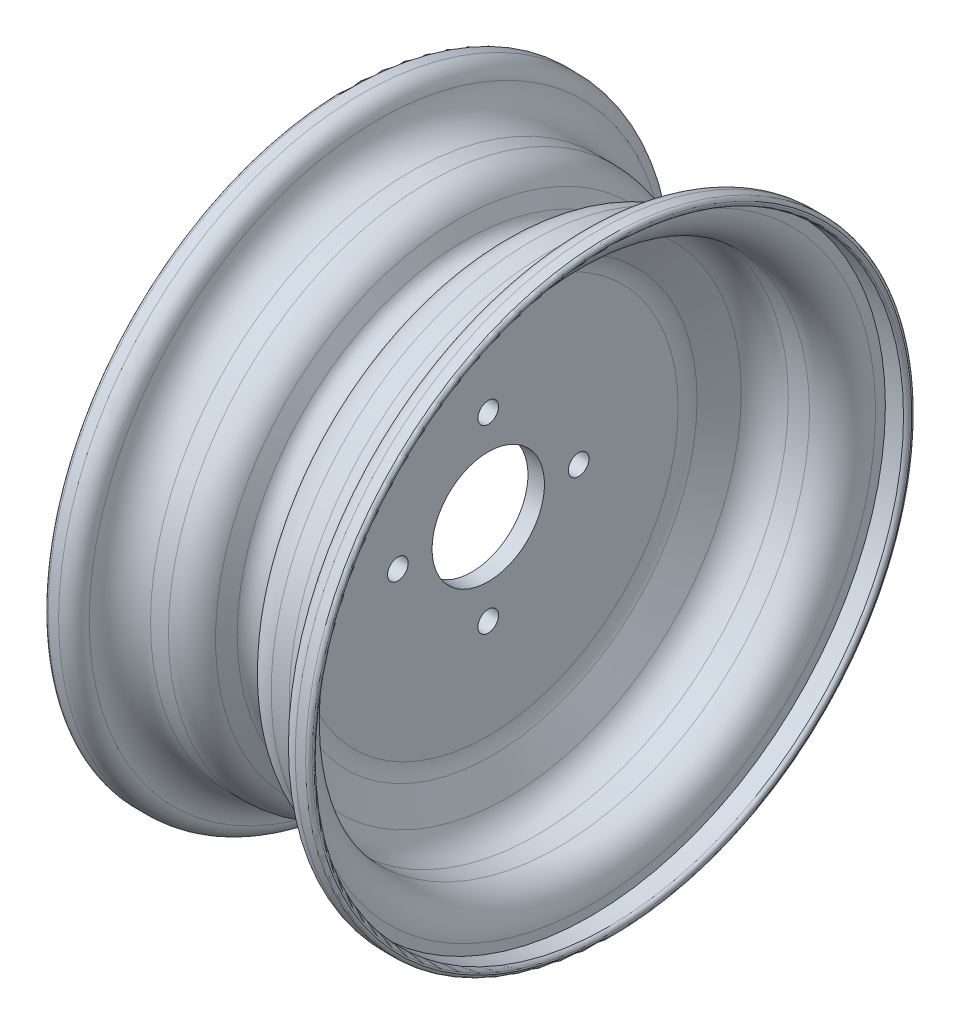
ISO-10303-21;
HEADER;
FILE_DESCRIPTION(('STEP AP214'),'2;1');
FILE_NAME('part.step','',(''),(''),'','','');
FILE_SCHEMA(('AUTOMOTIVE_DESIGN { 1 0 10303 214 1 1 1 1 }'));
ENDSEC;
DATA;
#1=APPLICATION_CONTEXT('core data for automotive mechanical design processes');
#2=APPLICATION_PROTOCOL_DEFINITION('international standard','automotive_design',2000,#1);
#3=PRODUCT_CONTEXT('',#1,'mechanical');
#4=PRODUCT('Part','Part','',(#3));
#5=PRODUCT_RELATED_PRODUCT_CATEGORY('part','',(#4));
#6=PRODUCT_DEFINITION_FORMATION('','',#4);
#7=PRODUCT_DEFINITION_CONTEXT('part definition',#1,'design');
#8=PRODUCT_DEFINITION('design','',#6,#7);
#9=PRODUCT_DEFINITION_SHAPE('','',#8);
#10=(LENGTH_UNIT() NAMED_UNIT(*) SI_UNIT(.MILLI.,.METRE.));
#11=(NAMED_UNIT(*) PLANE_ANGLE_UNIT() SI_UNIT($,.RADIAN.));
#12=(NAMED_UNIT(*) SI_UNIT($,.STERADIAN.) SOLID_ANGLE_UNIT());
#13=UNCERTAINTY_MEASURE_WITH_UNIT(LENGTH_MEASURE(1.E-05),#10,'distance_accuracy_value','');
#14=(GEOMETRIC_REPRESENTATION_CONTEXT(3) GLOBAL_UNCERTAINTY_ASSIGNED_CONTEXT((#13)) GLOBAL_UNIT_ASSIGNED_CONTEXT((#10,
#11,#12)) REPRESENTATION_CONTEXT('',''));
#15=CARTESIAN_POINT('',(0.,0.,0.));
#16=DIRECTION('',(0.,0.,1.));
#17=DIRECTION('',(1.,0.,0.));
#18=AXIS2_PLACEMENT_3D('',#15,#16,#17);
#19=CARTESIAN_POINT('',(0.,0.,0.));
#20=DIRECTION('',(-1.,0.,0.));
#21=DIRECTION('',(0.,0.,1.));
#22=AXIS2_PLACEMENT_3D('',#19,#20,#21);
#23=CYLINDRICAL_SURFACE('',#22,21.6360375);
#24=CARTESIAN_POINT('',(3.17500000000001,0.,0.));
#25=DIRECTION('',(-1.,0.,0.));
#26=DIRECTION('',(0.,0.,1.));
#27=AXIS2_PLACEMENT_3D('',#24,#25,#26);
#28=CIRCLE('',#27,21.6360375);
#29=CARTESIAN_POINT('',(3.17500000000001,0.,21.6360375));
#30=VERTEX_POINT('',#29);
#31=EDGE_CURVE('E139',#30,#30,#28,.T.);
#32=ORIENTED_EDGE('',*,*,#31,.F.);
#33=EDGE_LOOP('',(#32));
#34=FACE_BOUND('',#33,.T.);
#35=CARTESIAN_POINT('',(-3.17500000000001,0.,0.));
#36=DIRECTION('',(-1.,0.,0.));
#37=DIRECTION('',(0.,0.,1.));
#38=AXIS2_PLACEMENT_3D('',#35,#36,#37);
#39=CIRCLE('',#38,21.6360375);
#40=CARTESIAN_POINT('',(-3.17500000000001,0.,21.6360375));
#41=VERTEX_POINT('',#40);
#42=EDGE_CURVE('E157',#41,#41,#39,.T.);
#43=ORIENTED_EDGE('',*,*,#42,.T.);
#44=EDGE_LOOP('',(#43));
#45=FACE_BOUND('',#44,.T.);
#46=ADVANCED_FACE('F35',(#34,#45),#23,.F.);
#47=CARTESIAN_POINT('',(3.175,21.6360375,0.));
#48=DIRECTION('',(-1.,0.,0.));
#49=DIRECTION('',(0.,0.,1.));
#50=AXIS2_PLACEMENT_3D('',#47,#48,#49);
#51=PLANE('',#50);
#52=CARTESIAN_POINT('',(3.175,3.6448970288719E-13,34.798));
#53=DIRECTION('',(1.,0.,0.));
#54=DIRECTION('',(0.,1.,0.));
#55=AXIS2_PLACEMENT_3D('',#52,#53,#54);
#56=CIRCLE('',#55,3.9751);
#57=CARTESIAN_POINT('',(3.175,3.97510000000036,34.798));
#58=VERTEX_POINT('',#57);
#59=EDGE_CURVE('E154',#58,#58,#56,.T.);
#60=ORIENTED_EDGE('',*,*,#59,.F.);
#61=EDGE_LOOP('',(#60));
#62=FACE_BOUND('',#61,.T.);
#63=CARTESIAN_POINT('',(3.175,-34.798,0.));
#64=DIRECTION('',(1.,0.,0.));
#65=DIRECTION('',(0.,0.,1.));
#66=AXIS2_PLACEMENT_3D('',#63,#64,#65);
#67=CIRCLE('',#66,3.9751);
#68=CARTESIAN_POINT('',(3.175,-34.798,3.9751));
#69=VERTEX_POINT('',#68);
#70=EDGE_CURVE('E151',#69,#69,#67,.T.);
#71=ORIENTED_EDGE('',*,*,#70,.F.);
#72=EDGE_LOOP('',(#71));
#73=FACE_BOUND('',#72,.T.);
#74=CARTESIAN_POINT('',(3.175,-1.21496567629063E-13,-34.798));
#75=DIRECTION('',(1.,0.,0.));
#76=DIRECTION('',(0.,-1.,0.));
#77=AXIS2_PLACEMENT_3D('',#74,#75,#76);
#78=CIRCLE('',#77,3.9751);
#79=CARTESIAN_POINT('',(3.175,-3.97510000000012,-34.798));
#80=VERTEX_POINT('',#79);
#81=EDGE_CURVE('E148',#80,#80,#78,.T.);
#82=ORIENTED_EDGE('',*,*,#81,.F.);
#83=EDGE_LOOP('',(#82));
#84=FACE_BOUND('',#83,.T.);
#85=CARTESIAN_POINT('',(3.175,34.798,0.));
#86=DIRECTION('',(1.,0.,0.));
#87=DIRECTION('',(0.,0.,-1.));
#88=AXIS2_PLACEMENT_3D('',#85,#86,#87);
#89=CIRCLE('',#88,3.9751);
#90=CARTESIAN_POINT('',(3.175,34.798,-3.9751));
#91=VERTEX_POINT('',#90);
#92=EDGE_CURVE('E145',#91,#91,#89,.T.);
#93=ORIENTED_EDGE('',*,*,#92,.F.);
#94=EDGE_LOOP('',(#93));
#95=FACE_BOUND('',#94,.T.);
#96=CARTESIAN_POINT('',(3.175,0.,0.));
#97=DIRECTION('',(-1.,0.,0.));
#98=DIRECTION('',(0.,0.,1.));
#99=AXIS2_PLACEMENT_3D('',#96,#97,#98);
#100=CIRCLE('',#99,73.1001867170901);
#101=CARTESIAN_POINT('',(3.175,0.,73.1001867170901));
#102=VERTEX_POINT('',#101);
#103=EDGE_CURVE('E94',#102,#102,#100,.F.);
#104=ORIENTED_EDGE('',*,*,#103,.T.);
#105=EDGE_LOOP('',(#104));
#106=FACE_BOUND('',#105,.T.);
#107=ORIENTED_EDGE('',*,*,#31,.T.);
#108=EDGE_LOOP('',(#107));
#109=FACE_BOUND('',#108,.T.);
#110=ADVANCED_FACE('F194',(#62,#73,#84,#95,#106,#109),#51,.F.);
#111=CARTESIAN_POINT('',(3.175,0.,0.));
#112=DIRECTION('',(1.,0.,0.));
#113=DIRECTION('',(0.,0.,-1.));
#114=AXIS2_PLACEMENT_3D('',#111,#112,#113);
#115=CONICAL_SURFACE('',#114,76.2,1.09199836191932);
#116=CARTESIAN_POINT('',(10.4148201420796,0.,0.));
#117=DIRECTION('',(1.,0.,0.));
#118=DIRECTION('',(0.,0.,-1.));
#119=AXIS2_PLACEMENT_3D('',#116,#117,#118);
#120=CIRCLE('',#119,90.14730056783);
#121=CARTESIAN_POINT('',(10.4148201420796,0.,-90.14730056783));
#122=VERTEX_POINT('',#121);
#123=EDGE_CURVE('E97',#122,#122,#120,.T.);
#124=ORIENTED_EDGE('',*,*,#123,.T.);
#125=EDGE_LOOP('',(#124));
#126=FACE_BOUND('',#125,.T.);
#127=CARTESIAN_POINT('',(4.60312317079817,0.,0.));
#128=DIRECTION('',(1.,0.,0.));
#129=DIRECTION('',(0.,0.,-1.));
#130=AXIS2_PLACEMENT_3D('',#127,#128,#129);
#131=CIRCLE('',#130,78.95123728492);
#132=CARTESIAN_POINT('',(4.60312317079817,0.,-78.95123728492));
#133=VERTEX_POINT('',#132);
#134=EDGE_CURVE('E100',#133,#133,#131,.F.);
#135=ORIENTED_EDGE('',*,*,#134,.T.);
#136=EDGE_LOOP('',(#135));
#137=FACE_BOUND('',#136,.T.);
#138=ADVANCED_FACE('F201',(#126,#137),#115,.F.);
#139=CARTESIAN_POINT('',(0.,0.,0.));
#140=DIRECTION('',(-1.,0.,0.));
#141=DIRECTION('',(0.,0.,1.));
#142=AXIS2_PLACEMENT_3D('',#139,#140,#141);
#143=CYLINDRICAL_SURFACE('',#142,96.99625);
#144=CARTESIAN_POINT('',(21.6866969712815,0.,0.));
#145=DIRECTION('',(-1.,0.,0.));
#146=DIRECTION('',(0.,0.,1.));
#147=AXIS2_PLACEMENT_3D('',#144,#145,#146);
#148=CIRCLE('',#147,96.99625);
#149=CARTESIAN_POINT('',(21.6866969712815,0.,96.99625));
#150=VERTEX_POINT('',#149);
#151=EDGE_CURVE('E103',#150,#150,#148,.T.);
#152=ORIENTED_EDGE('',*,*,#151,.T.);
#153=EDGE_LOOP('',(#152));
#154=FACE_BOUND('',#153,.T.);
#155=CARTESIAN_POINT('',(29.845,0.,0.));
#156=DIRECTION('',(-1.,0.,0.));
#157=DIRECTION('',(0.,0.,1.));
#158=AXIS2_PLACEMENT_3D('',#155,#156,#157);
#159=CIRCLE('',#158,96.99625);
#160=CARTESIAN_POINT('',(29.845,0.,96.99625));
#161=VERTEX_POINT('',#160);
#162=EDGE_CURVE('E106',#161,#161,#159,.F.);
#163=ORIENTED_EDGE('',*,*,#162,.T.);
#164=EDGE_LOOP('',(#163));
#165=FACE_BOUND('',#164,.T.);
#166=ADVANCED_FACE('F437',(#154,#165),#143,.F.);
#167=CARTESIAN_POINT('',(42.545,96.99625,0.));
#168=DIRECTION('',(-1.,0.,0.));
#169=DIRECTION('',(0.,0.,1.));
#170=AXIS2_PLACEMENT_3D('',#167,#168,#169);
#171=PLANE('',#170);
#172=CARTESIAN_POINT('',(42.545,0.,0.));
#173=DIRECTION('',(-1.,0.,0.));
#174=DIRECTION('',(0.,0.,1.));
#175=AXIS2_PLACEMENT_3D('',#172,#173,#174);
#176=CIRCLE('',#175,109.69625);
#177=CARTESIAN_POINT('',(42.545,0.,109.69625));
#178=VERTEX_POINT('',#177);
#179=EDGE_CURVE('E109',#178,#178,#176,.T.);
#180=ORIENTED_EDGE('',*,*,#179,.T.);
#181=EDGE_LOOP('',(#180));
#182=FACE_BOUND('',#181,.T.);
#183=CARTESIAN_POINT('',(42.545,0.,0.));
#184=DIRECTION('',(-1.,0.,0.));
#185=DIRECTION('',(0.,0.,1.));
#186=AXIS2_PLACEMENT_3D('',#183,#184,#185);
#187=CIRCLE('',#186,113.50625);
#188=CARTESIAN_POINT('',(42.545,0.,113.50625));
#189=VERTEX_POINT('',#188);
#190=EDGE_CURVE('E142',#189,#189,#187,.T.);
#191=ORIENTED_EDGE('',*,*,#190,.F.);
#192=EDGE_LOOP('',(#191));
#193=FACE_BOUND('',#192,.T.);
#194=ADVANCED_FACE('F444',(#182,#193),#171,.F.);
#195=CARTESIAN_POINT('',(0.,0.,0.));
#196=DIRECTION('',(-1.,0.,0.));
#197=DIRECTION('',(0.,0.,1.));
#198=AXIS2_PLACEMENT_3D('',#195,#196,#197);
#199=CYLINDRICAL_SURFACE('',#198,113.50625);
#200=CARTESIAN_POINT('',(49.53,0.,0.));
#201=DIRECTION('',(-1.,0.,0.));
#202=DIRECTION('',(0.,0.,1.));
#203=AXIS2_PLACEMENT_3D('',#200,#201,#202);
#204=CIRCLE('',#203,113.50625);
#205=CARTESIAN_POINT('',(49.53,0.,113.50625));
#206=VERTEX_POINT('',#205);
#207=EDGE_CURVE('E115',#206,#206,#204,.F.);
#208=ORIENTED_EDGE('',*,*,#207,.T.);
#209=EDGE_LOOP('',(#208));
#210=FACE_BOUND('',#209,.T.);
#211=ORIENTED_EDGE('',*,*,#190,.T.);
#212=EDGE_LOOP('',(#211));
#213=FACE_BOUND('',#212,.T.);
#214=ADVANCED_FACE('F452',(#210,#213),#199,.F.);
#215=CARTESIAN_POINT('',(50.8,113.50625,0.));
#216=DIRECTION('',(-1.,0.,0.));
#217=DIRECTION('',(0.,0.,1.));
#218=AXIS2_PLACEMENT_3D('',#215,#216,#217);
#219=PLANE('',#218);
#220=CARTESIAN_POINT('',(50.8,0.,0.));
#221=DIRECTION('',(-1.,0.,0.));
#222=DIRECTION('',(0.,0.,1.));
#223=AXIS2_PLACEMENT_3D('',#220,#221,#222);
#224=CIRCLE('',#223,114.77625);
#225=CARTESIAN_POINT('',(50.8,0.,114.77625));
#226=VERTEX_POINT('',#225);
#227=EDGE_CURVE('E118',#226,#226,#224,.T.);
#228=ORIENTED_EDGE('',*,*,#227,.T.);
#229=EDGE_LOOP('',(#228));
#230=FACE_BOUND('',#229,.T.);
#231=CARTESIAN_POINT('',(50.8,0.,0.));
#232=DIRECTION('',(-1.,0.,0.));
#233=DIRECTION('',(0.,0.,1.));
#234=AXIS2_PLACEMENT_3D('',#231,#232,#233);
#235=CIRCLE('',#234,115.41125);
#236=CARTESIAN_POINT('',(50.8,0.,115.41125));
#237=VERTEX_POINT('',#236);
#238=EDGE_CURVE('E121',#237,#237,#235,.F.);
#239=ORIENTED_EDGE('',*,*,#238,.T.);
#240=EDGE_LOOP('',(#239));
#241=FACE_BOUND('',#240,.T.);
#242=ADVANCED_FACE('F460',(#230,#241),#219,.F.);
#243=CARTESIAN_POINT('',(0.,0.,0.));
#244=DIRECTION('',(-1.,0.,0.));
#245=DIRECTION('',(0.,0.,1.));
#246=AXIS2_PLACEMENT_3D('',#243,#244,#245);
#247=CYLINDRICAL_SURFACE('',#246,116.68125);
#248=CARTESIAN_POINT('',(49.53,0.,0.));
#249=DIRECTION('',(-1.,0.,0.));
#250=DIRECTION('',(0.,0.,1.));
#251=AXIS2_PLACEMENT_3D('',#248,#249,#250);
#252=CIRCLE('',#251,116.68125);
#253=CARTESIAN_POINT('',(49.53,0.,116.68125));
#254=VERTEX_POINT('',#253);
#255=EDGE_CURVE('E112',#254,#254,#252,.T.);
#256=ORIENTED_EDGE('',*,*,#255,.T.);
#257=EDGE_LOOP('',(#256));
#258=FACE_BOUND('',#257,.T.);
#259=CARTESIAN_POINT('',(45.5499073090945,0.,0.));
#260=DIRECTION('',(1.,0.,0.));
#261=DIRECTION('',(0.,0.,-1.));
#262=AXIS2_PLACEMENT_3D('',#259,#260,#261);
#263=CIRCLE('',#262,116.68125);
#264=CARTESIAN_POINT('',(45.5499073090945,0.,-116.68125));
#265=VERTEX_POINT('',#264);
#266=EDGE_CURVE('E124',#265,#265,#263,.T.);
#267=ORIENTED_EDGE('',*,*,#266,.T.);
#268=EDGE_LOOP('',(#267));
#269=FACE_BOUND('',#268,.T.);
#270=ADVANCED_FACE('F468',(#258,#269),#247,.T.);
#271=CARTESIAN_POINT('',(0.,0.,0.));
#272=DIRECTION('',(-1.,0.,0.));
#273=DIRECTION('',(0.,0.,1.));
#274=AXIS2_PLACEMENT_3D('',#271,#272,#273);
#275=CYLINDRICAL_SURFACE('',#274,100.17125);
#276=CARTESIAN_POINT('',(26.67,0.,0.));
#277=DIRECTION('',(1.,0.,0.));
#278=DIRECTION('',(0.,0.,-1.));
#279=AXIS2_PLACEMENT_3D('',#276,#277,#278);
#280=CIRCLE('',#279,100.17125);
#281=CARTESIAN_POINT('',(26.67,0.,-100.17125));
#282=VERTEX_POINT('',#281);
#283=EDGE_CURVE('E130',#282,#282,#280,.F.);
#284=ORIENTED_EDGE('',*,*,#283,.T.);
#285=EDGE_LOOP('',(#284));
#286=FACE_BOUND('',#285,.T.);
#287=CARTESIAN_POINT('',(19.7575227284611,0.,0.));
#288=DIRECTION('',(1.,0.,0.));
#289=DIRECTION('',(0.,0.,-1.));
#290=AXIS2_PLACEMENT_3D('',#287,#288,#289);
#291=CIRCLE('',#290,100.17125);
#292=CARTESIAN_POINT('',(19.7575227284611,0.,-100.17125));
#293=VERTEX_POINT('',#292);
#294=EDGE_CURVE('E133',#293,#293,#291,.T.);
#295=ORIENTED_EDGE('',*,*,#294,.T.);
#296=EDGE_LOOP('',(#295));
#297=FACE_BOUND('',#296,.T.);
#298=ADVANCED_FACE('F476',(#286,#297),#275,.T.);
#299=CARTESIAN_POINT('',(12.0408257571796,0.,0.));
#300=DIRECTION('',(1.,0.,0.));
#301=DIRECTION('',(0.,0.,-1.));
#302=AXIS2_PLACEMENT_3D('',#299,#300,#301);
#303=CONICAL_SURFACE('',#302,100.17125,1.09199836191932);
#304=CARTESIAN_POINT('',(5.63593841460092,0.,0.));
#305=DIRECTION('',(1.,0.,0.));
#306=DIRECTION('',(0.,0.,-1.));
#307=AXIS2_PLACEMENT_3D('',#304,#305,#306);
#308=CIRCLE('',#307,87.8324229135616);
#309=CARTESIAN_POINT('',(5.63593841460092,0.,-87.8324229135616));
#310=VERTEX_POINT('',#309);
#311=EDGE_CURVE('E10',#310,#310,#308,.T.);
#312=ORIENTED_EDGE('',*,*,#311,.T.);
#313=EDGE_LOOP('',(#312));
#314=FACE_BOUND('',#313,.T.);
#315=CARTESIAN_POINT('',(8.48564589925927,0.,0.));
#316=DIRECTION('',(-1.,0.,0.));
#317=DIRECTION('',(0.,0.,1.));
#318=AXIS2_PLACEMENT_3D('',#315,#316,#317);
#319=CIRCLE('',#318,93.3223005678299);
#320=CARTESIAN_POINT('',(8.48564589925927,0.,93.3223005678299));
#321=VERTEX_POINT('',#320);
#322=EDGE_CURVE('E136',#321,#321,#319,.T.);
#323=ORIENTED_EDGE('',*,*,#322,.T.);
#324=EDGE_LOOP('',(#323));
#325=FACE_BOUND('',#324,.T.);
#326=ADVANCED_FACE('F212',(#314,#325),#303,.T.);
#327=CARTESIAN_POINT('',(19.7575227284611,0.,0.));
#328=DIRECTION('',(1.,0.,0.));
#329=DIRECTION('',(0.,0.,-1.));
#330=AXIS2_PLACEMENT_3D('',#327,#328,#329);
#331=TOROIDAL_SURFACE('',#330,87.47125,12.7);
#332=ORIENTED_EDGE('',*,*,#294,.F.);
#333=EDGE_LOOP('',(#332));
#334=FACE_BOUND('',#333,.T.);
#335=ORIENTED_EDGE('',*,*,#322,.F.);
#336=EDGE_LOOP('',(#335));
#337=FACE_BOUND('',#336,.T.);
#338=ADVANCED_FACE('F208',(#334,#337),#331,.T.);
#339=CARTESIAN_POINT('',(26.67,0.,0.));
#340=DIRECTION('',(1.,0.,0.));
#341=DIRECTION('',(0.,0.,-1.));
#342=AXIS2_PLACEMENT_3D('',#339,#340,#341);
#343=TOROIDAL_SURFACE('',#342,112.87125,12.7);
#344=CARTESIAN_POINT('',(39.2566048727302,0.,0.));
#345=DIRECTION('',(-1.,0.,0.));
#346=DIRECTION('',(0.,0.,1.));
#347=AXIS2_PLACEMENT_3D('',#344,#345,#346);
#348=CIRCLE('',#347,111.177916666667);
#349=CARTESIAN_POINT('',(39.2566048727302,0.,111.177916666667));
#350=VERTEX_POINT('',#349);
#351=EDGE_CURVE('E127',#350,#350,#348,.T.);
#352=ORIENTED_EDGE('',*,*,#351,.T.);
#353=EDGE_LOOP('',(#352));
#354=FACE_BOUND('',#353,.T.);
#355=ORIENTED_EDGE('',*,*,#283,.F.);
#356=EDGE_LOOP('',(#355));
#357=FACE_BOUND('',#356,.T.);
#358=ADVANCED_FACE('F211',(#354,#357),#343,.F.);
#359=CARTESIAN_POINT('',(45.5499073090945,0.,0.));
#360=DIRECTION('',(1.,0.,0.));
#361=DIRECTION('',(0.,0.,-1.));
#362=AXIS2_PLACEMENT_3D('',#359,#360,#361);
#363=TOROIDAL_SURFACE('',#362,110.33125,6.35);
#364=ORIENTED_EDGE('',*,*,#266,.F.);
#365=EDGE_LOOP('',(#364));
#366=FACE_BOUND('',#365,.T.);
#367=ORIENTED_EDGE('',*,*,#351,.F.);
#368=EDGE_LOOP('',(#367));
#369=FACE_BOUND('',#368,.T.);
#370=ADVANCED_FACE('F216',(#366,#369),#363,.T.);
#371=CARTESIAN_POINT('',(49.53,0.,0.));
#372=DIRECTION('',(-1.,0.,0.));
#373=DIRECTION('',(0.,0.,1.));
#374=AXIS2_PLACEMENT_3D('',#371,#372,#373);
#375=TOROIDAL_SURFACE('',#374,114.77625,1.27);
#376=ORIENTED_EDGE('',*,*,#207,.F.);
#377=EDGE_LOOP('',(#376));
#378=FACE_BOUND('',#377,.T.);
#379=ORIENTED_EDGE('',*,*,#227,.F.);
#380=EDGE_LOOP('',(#379));
#381=FACE_BOUND('',#380,.T.);
#382=ADVANCED_FACE('F220',(#378,#381),#375,.T.);
#383=CARTESIAN_POINT('',(49.53,0.,0.));
#384=DIRECTION('',(-1.,0.,0.));
#385=DIRECTION('',(0.,0.,1.));
#386=AXIS2_PLACEMENT_3D('',#383,#384,#385);
#387=TOROIDAL_SURFACE('',#386,115.41125,1.27);
#388=ORIENTED_EDGE('',*,*,#238,.F.);
#389=EDGE_LOOP('',(#388));
#390=FACE_BOUND('',#389,.T.);
#391=ORIENTED_EDGE('',*,*,#255,.F.);
#392=EDGE_LOOP('',(#391));
#393=FACE_BOUND('',#392,.T.);
#394=ADVANCED_FACE('F224',(#390,#393),#387,.T.);
#395=CARTESIAN_POINT('',(29.845,0.,0.));
#396=DIRECTION('',(-1.,0.,0.));
#397=DIRECTION('',(0.,0.,1.));
#398=AXIS2_PLACEMENT_3D('',#395,#396,#397);
#399=TOROIDAL_SURFACE('',#398,109.69625,12.7);
#400=ORIENTED_EDGE('',*,*,#162,.F.);
#401=EDGE_LOOP('',(#400));
#402=FACE_BOUND('',#401,.T.);
#403=ORIENTED_EDGE('',*,*,#179,.F.);
#404=EDGE_LOOP('',(#403));
#405=FACE_BOUND('',#404,.T.);
#406=ADVANCED_FACE('F228',(#402,#405),#399,.T.);
#407=CARTESIAN_POINT('',(21.6866969712815,0.,0.));
#408=DIRECTION('',(-1.,0.,0.));
#409=DIRECTION('',(0.,0.,1.));
#410=AXIS2_PLACEMENT_3D('',#407,#408,#409);
#411=TOROIDAL_SURFACE('',#410,84.29625,12.7);
#412=ORIENTED_EDGE('',*,*,#123,.F.);
#413=EDGE_LOOP('',(#412));
#414=FACE_BOUND('',#413,.T.);
#415=ORIENTED_EDGE('',*,*,#151,.F.);
#416=EDGE_LOOP('',(#415));
#417=FACE_BOUND('',#416,.T.);
#418=ADVANCED_FACE('F232',(#414,#417),#411,.F.);
#419=CARTESIAN_POINT('',(15.875,0.,0.));
#420=DIRECTION('',(-1.,0.,0.));
#421=DIRECTION('',(0.,0.,1.));
#422=AXIS2_PLACEMENT_3D('',#419,#420,#421);
#423=TOROIDAL_SURFACE('',#422,73.1001867170901,12.7);
#424=ORIENTED_EDGE('',*,*,#103,.F.);
#425=EDGE_LOOP('',(#424));
#426=FACE_BOUND('',#425,.T.);
#427=ORIENTED_EDGE('',*,*,#134,.F.);
#428=EDGE_LOOP('',(#427));
#429=FACE_BOUND('',#428,.T.);
#430=ADVANCED_FACE('F236',(#426,#429),#423,.F.);
#431=CARTESIAN_POINT('',(-0.000999999999996663,34.798,0.));
#432=DIRECTION('',(1.,0.,0.));
#433=DIRECTION('',(0.,0.,-1.));
#434=AXIS2_PLACEMENT_3D('',#431,#432,#433);
#435=CYLINDRICAL_SURFACE('',#434,3.9751);
#436=ORIENTED_EDGE('',*,*,#92,.T.);
#437=EDGE_LOOP('',(#436));
#438=FACE_BOUND('',#437,.T.);
#439=CARTESIAN_POINT('',(-3.175,34.798,0.));
#440=DIRECTION('',(1.,0.,0.));
#441=DIRECTION('',(0.,0.,-1.));
#442=AXIS2_PLACEMENT_3D('',#439,#440,#441);
#443=CIRCLE('',#442,3.9751);
#444=CARTESIAN_POINT('',(-3.175,34.798,-3.9751));
#445=VERTEX_POINT('',#444);
#446=EDGE_CURVE('E163',#445,#445,#443,.T.);
#447=ORIENTED_EDGE('',*,*,#446,.F.);
#448=EDGE_LOOP('',(#447));
#449=FACE_BOUND('',#448,.T.);
#450=ADVANCED_FACE('F240',(#438,#449),#435,.F.);
#451=CARTESIAN_POINT('',(-0.000999999999996663,-1.21496567629063E-13,-34.798));
#452=DIRECTION('',(1.,0.,0.));
#453=DIRECTION('',(0.,0.,-1.));
#454=AXIS2_PLACEMENT_3D('',#451,#452,#453);
#455=CYLINDRICAL_SURFACE('',#454,3.9751);
#456=ORIENTED_EDGE('',*,*,#81,.T.);
#457=EDGE_LOOP('',(#456));
#458=FACE_BOUND('',#457,.T.);
#459=CARTESIAN_POINT('',(-3.175,-1.21496567629063E-13,-34.798));
#460=DIRECTION('',(1.,0.,0.));
#461=DIRECTION('',(0.,-1.,0.));
#462=AXIS2_PLACEMENT_3D('',#459,#460,#461);
#463=CIRCLE('',#462,3.9751);
#464=CARTESIAN_POINT('',(-3.175,-3.97510000000012,-34.798));
#465=VERTEX_POINT('',#464);
#466=EDGE_CURVE('E166',#465,#465,#463,.T.);
#467=ORIENTED_EDGE('',*,*,#466,.F.);
#468=EDGE_LOOP('',(#467));
#469=FACE_BOUND('',#468,.T.);
#470=ADVANCED_FACE('F190',(#458,#469),#455,.F.);
#471=CARTESIAN_POINT('',(-0.000999999999996663,-34.798,0.));
#472=DIRECTION('',(1.,0.,0.));
#473=DIRECTION('',(0.,0.,-1.));
#474=AXIS2_PLACEMENT_3D('',#471,#472,#473);
#475=CYLINDRICAL_SURFACE('',#474,3.9751);
#476=ORIENTED_EDGE('',*,*,#70,.T.);
#477=EDGE_LOOP('',(#476));
#478=FACE_BOUND('',#477,.T.);
#479=CARTESIAN_POINT('',(-3.175,-34.798,0.));
#480=DIRECTION('',(1.,0.,0.));
#481=DIRECTION('',(0.,0.,1.));
#482=AXIS2_PLACEMENT_3D('',#479,#480,#481);
#483=CIRCLE('',#482,3.9751);
#484=CARTESIAN_POINT('',(-3.175,-34.798,3.9751));
#485=VERTEX_POINT('',#484);
#486=EDGE_CURVE('E169',#485,#485,#483,.T.);
#487=ORIENTED_EDGE('',*,*,#486,.F.);
#488=EDGE_LOOP('',(#487));
#489=FACE_BOUND('',#488,.T.);
#490=ADVANCED_FACE('F181',(#478,#489),#475,.F.);
#491=CARTESIAN_POINT('',(-0.000999999999996663,3.6448970288719E-13,34.798));
#492=DIRECTION('',(1.,0.,0.));
#493=DIRECTION('',(0.,0.,-1.));
#494=AXIS2_PLACEMENT_3D('',#491,#492,#493);
#495=CYLINDRICAL_SURFACE('',#494,3.9751);
#496=ORIENTED_EDGE('',*,*,#59,.T.);
#497=EDGE_LOOP('',(#496));
#498=FACE_BOUND('',#497,.T.);
#499=CARTESIAN_POINT('',(-3.175,3.6448970288719E-13,34.798));
#500=DIRECTION('',(1.,0.,0.));
#501=DIRECTION('',(0.,1.,0.));
#502=AXIS2_PLACEMENT_3D('',#499,#500,#501);
#503=CIRCLE('',#502,3.9751);
#504=CARTESIAN_POINT('',(-3.175,3.97510000000036,34.798));
#505=VERTEX_POINT('',#504);
#506=EDGE_CURVE('E172',#505,#505,#503,.T.);
#507=ORIENTED_EDGE('',*,*,#506,.F.);
#508=EDGE_LOOP('',(#507));
#509=FACE_BOUND('',#508,.T.);
#510=ADVANCED_FACE('F179',(#498,#509),#495,.F.);
#511=CARTESIAN_POINT('',(-3.175,21.6360375,0.));
#512=DIRECTION('',(1.,0.,0.));
#513=DIRECTION('',(0.,0.,1.));
#514=AXIS2_PLACEMENT_3D('',#511,#512,#513);
#515=PLANE('',#514);
#516=ORIENTED_EDGE('',*,*,#506,.T.);
#517=EDGE_LOOP('',(#516));
#518=FACE_BOUND('',#517,.T.);
#519=ORIENTED_EDGE('',*,*,#486,.T.);
#520=EDGE_LOOP('',(#519));
#521=FACE_BOUND('',#520,.T.);
#522=ORIENTED_EDGE('',*,*,#466,.T.);
#523=EDGE_LOOP('',(#522));
#524=FACE_BOUND('',#523,.T.);
#525=ORIENTED_EDGE('',*,*,#446,.T.);
#526=EDGE_LOOP('',(#525));
#527=FACE_BOUND('',#526,.T.);
#528=CARTESIAN_POINT('',(-3.175,0.,0.));
#529=DIRECTION('',(1.,0.,0.));
#530=DIRECTION('',(0.,0.,-1.));
#531=AXIS2_PLACEMENT_3D('',#528,#529,#530);
#532=CIRCLE('',#531,73.1001867170901);
#533=CARTESIAN_POINT('',(-3.175,0.,-73.1001867170901));
#534=VERTEX_POINT('',#533);
#535=EDGE_CURVE('E46',#534,#534,#532,.F.);
#536=ORIENTED_EDGE('',*,*,#535,.T.);
#537=EDGE_LOOP('',(#536));
#538=FACE_BOUND('',#537,.T.);
#539=ORIENTED_EDGE('',*,*,#42,.F.);
#540=EDGE_LOOP('',(#539));
#541=FACE_BOUND('',#540,.T.);
#542=ADVANCED_FACE('F176',(#518,#521,#524,#527,#538,#541),#515,.F.);
#543=CARTESIAN_POINT('',(-3.175,0.,0.));
#544=DIRECTION('',(-1.,0.,0.));
#545=DIRECTION('',(0.,0.,-1.));
#546=AXIS2_PLACEMENT_3D('',#543,#544,#545);
#547=CONICAL_SURFACE('',#546,76.2,1.09199836191932);
#548=CARTESIAN_POINT('',(-10.4148201420796,0.,0.));
#549=DIRECTION('',(-1.,0.,0.));
#550=DIRECTION('',(0.,0.,1.));
#551=AXIS2_PLACEMENT_3D('',#548,#549,#550);
#552=CIRCLE('',#551,90.14730056783);
#553=CARTESIAN_POINT('',(-10.4148201420796,0.,90.14730056783));
#554=VERTEX_POINT('',#553);
#555=EDGE_CURVE('E55',#554,#554,#552,.T.);
#556=ORIENTED_EDGE('',*,*,#555,.T.);
#557=EDGE_LOOP('',(#556));
#558=FACE_BOUND('',#557,.T.);
#559=CARTESIAN_POINT('',(-4.60312317079817,0.,0.));
#560=DIRECTION('',(-1.,0.,0.));
#561=DIRECTION('',(0.,0.,1.));
#562=AXIS2_PLACEMENT_3D('',#559,#560,#561);
#563=CIRCLE('',#562,78.95123728492);
#564=CARTESIAN_POINT('',(-4.60312317079817,0.,78.95123728492));
#565=VERTEX_POINT('',#564);
#566=EDGE_CURVE('E58',#565,#565,#563,.F.);
#567=ORIENTED_EDGE('',*,*,#566,.T.);
#568=EDGE_LOOP('',(#567));
#569=FACE_BOUND('',#568,.T.);
#570=ADVANCED_FACE('F188',(#558,#569),#547,.F.);
#571=CARTESIAN_POINT('',(0.,0.,0.));
#572=DIRECTION('',(1.,0.,0.));
#573=DIRECTION('',(0.,0.,1.));
#574=AXIS2_PLACEMENT_3D('',#571,#572,#573);
#575=CYLINDRICAL_SURFACE('',#574,96.99625);
#576=CARTESIAN_POINT('',(-21.6866969712815,0.,0.));
#577=DIRECTION('',(-1.,0.,0.));
#578=DIRECTION('',(0.,0.,1.));
#579=AXIS2_PLACEMENT_3D('',#576,#577,#578);
#580=CIRCLE('',#579,96.99625);
#581=CARTESIAN_POINT('',(-21.6866969712815,0.,96.99625));
#582=VERTEX_POINT('',#581);
#583=EDGE_CURVE('E50',#582,#582,#580,.F.);
#584=ORIENTED_EDGE('',*,*,#583,.T.);
#585=EDGE_LOOP('',(#584));
#586=FACE_BOUND('',#585,.T.);
#587=CARTESIAN_POINT('',(-29.845,0.,0.));
#588=DIRECTION('',(1.,0.,0.));
#589=DIRECTION('',(0.,0.,-1.));
#590=AXIS2_PLACEMENT_3D('',#587,#588,#589);
#591=CIRCLE('',#590,96.99625);
#592=CARTESIAN_POINT('',(-29.845,0.,-96.99625));
#593=VERTEX_POINT('',#592);
#594=EDGE_CURVE('E64',#593,#593,#591,.F.);
#595=ORIENTED_EDGE('',*,*,#594,.T.);
#596=EDGE_LOOP('',(#595));
#597=FACE_BOUND('',#596,.T.);
#598=ADVANCED_FACE('F286',(#586,#597),#575,.F.);
#599=CARTESIAN_POINT('',(-42.545,96.99625,0.));
#600=DIRECTION('',(1.,0.,0.));
#601=DIRECTION('',(0.,0.,1.));
#602=AXIS2_PLACEMENT_3D('',#599,#600,#601);
#603=PLANE('',#602);
#604=CARTESIAN_POINT('',(-42.545,0.,0.));
#605=DIRECTION('',(1.,0.,0.));
#606=DIRECTION('',(0.,0.,-1.));
#607=AXIS2_PLACEMENT_3D('',#604,#605,#606);
#608=CIRCLE('',#607,109.69625);
#609=CARTESIAN_POINT('',(-42.545,0.,-109.69625));
#610=VERTEX_POINT('',#609);
#611=EDGE_CURVE('E61',#610,#610,#608,.T.);
#612=ORIENTED_EDGE('',*,*,#611,.T.);
#613=EDGE_LOOP('',(#612));
#614=FACE_BOUND('',#613,.T.);
#615=CARTESIAN_POINT('',(-42.545,0.,0.));
#616=DIRECTION('',(-1.,0.,0.));
#617=DIRECTION('',(0.,0.,1.));
#618=AXIS2_PLACEMENT_3D('',#615,#616,#617);
#619=CIRCLE('',#618,113.50625);
#620=CARTESIAN_POINT('',(-42.545,0.,113.50625));
#621=VERTEX_POINT('',#620);
#622=EDGE_CURVE('E160',#621,#621,#619,.T.);
#623=ORIENTED_EDGE('',*,*,#622,.T.);
#624=EDGE_LOOP('',(#623));
#625=FACE_BOUND('',#624,.T.);
#626=ADVANCED_FACE('F292',(#614,#625),#603,.F.);
#627=CARTESIAN_POINT('',(0.,0.,0.));
#628=DIRECTION('',(1.,0.,0.));
#629=DIRECTION('',(0.,0.,1.));
#630=AXIS2_PLACEMENT_3D('',#627,#628,#629);
#631=CYLINDRICAL_SURFACE('',#630,113.50625);
#632=CARTESIAN_POINT('',(-49.53,0.,0.));
#633=DIRECTION('',(1.,0.,0.));
#634=DIRECTION('',(0.,0.,-1.));
#635=AXIS2_PLACEMENT_3D('',#632,#633,#634);
#636=CIRCLE('',#635,113.50625);
#637=CARTESIAN_POINT('',(-49.53,0.,-113.50625));
#638=VERTEX_POINT('',#637);
#639=EDGE_CURVE('E76',#638,#638,#636,.F.);
#640=ORIENTED_EDGE('',*,*,#639,.T.);
#641=EDGE_LOOP('',(#640));
#642=FACE_BOUND('',#641,.T.);
#643=ORIENTED_EDGE('',*,*,#622,.F.);
#644=EDGE_LOOP('',(#643));
#645=FACE_BOUND('',#644,.T.);
#646=ADVANCED_FACE('F298',(#642,#645),#631,.F.);
#647=CARTESIAN_POINT('',(-50.8,113.50625,0.));
#648=DIRECTION('',(1.,0.,0.));
#649=DIRECTION('',(0.,0.,1.));
#650=AXIS2_PLACEMENT_3D('',#647,#648,#649);
#651=PLANE('',#650);
#652=CARTESIAN_POINT('',(-50.8,0.,0.));
#653=DIRECTION('',(1.,0.,0.));
#654=DIRECTION('',(0.,0.,-1.));
#655=AXIS2_PLACEMENT_3D('',#652,#653,#654);
#656=CIRCLE('',#655,114.77625);
#657=CARTESIAN_POINT('',(-50.8,0.,-114.77625));
#658=VERTEX_POINT('',#657);
#659=EDGE_CURVE('E70',#658,#658,#656,.T.);
#660=ORIENTED_EDGE('',*,*,#659,.T.);
#661=EDGE_LOOP('',(#660));
#662=FACE_BOUND('',#661,.T.);
#663=CARTESIAN_POINT('',(-50.8,0.,0.));
#664=DIRECTION('',(1.,0.,0.));
#665=DIRECTION('',(0.,0.,-1.));
#666=AXIS2_PLACEMENT_3D('',#663,#664,#665);
#667=CIRCLE('',#666,115.41125);
#668=CARTESIAN_POINT('',(-50.8,0.,-115.41125));
#669=VERTEX_POINT('',#668);
#670=EDGE_CURVE('E73',#669,#669,#667,.F.);
#671=ORIENTED_EDGE('',*,*,#670,.T.);
#672=EDGE_LOOP('',(#671));
#673=FACE_BOUND('',#672,.T.);
#674=ADVANCED_FACE('F302',(#662,#673),#651,.F.);
#675=CARTESIAN_POINT('',(0.,0.,0.));
#676=DIRECTION('',(1.,0.,0.));
#677=DIRECTION('',(0.,0.,1.));
#678=AXIS2_PLACEMENT_3D('',#675,#676,#677);
#679=CYLINDRICAL_SURFACE('',#678,116.68125);
#680=CARTESIAN_POINT('',(-49.53,0.,0.));
#681=DIRECTION('',(1.,0.,0.));
#682=DIRECTION('',(0.,0.,-1.));
#683=AXIS2_PLACEMENT_3D('',#680,#681,#682);
#684=CIRCLE('',#683,116.68125);
#685=CARTESIAN_POINT('',(-49.53,0.,-116.68125));
#686=VERTEX_POINT('',#685);
#687=EDGE_CURVE('E67',#686,#686,#684,.T.);
#688=ORIENTED_EDGE('',*,*,#687,.T.);
#689=EDGE_LOOP('',(#688));
#690=FACE_BOUND('',#689,.T.);
#691=CARTESIAN_POINT('',(-45.5499073090945,0.,0.));
#692=DIRECTION('',(1.,0.,0.));
#693=DIRECTION('',(0.,0.,-1.));
#694=AXIS2_PLACEMENT_3D('',#691,#692,#693);
#695=CIRCLE('',#694,116.68125);
#696=CARTESIAN_POINT('',(-45.5499073090945,0.,-116.68125));
#697=VERTEX_POINT('',#696);
#698=EDGE_CURVE('E82',#697,#697,#695,.F.);
#699=ORIENTED_EDGE('',*,*,#698,.T.);
#700=EDGE_LOOP('',(#699));
#701=FACE_BOUND('',#700,.T.);
#702=ADVANCED_FACE('F306',(#690,#701),#679,.T.);
#703=CARTESIAN_POINT('',(0.,0.,0.));
#704=DIRECTION('',(1.,0.,0.));
#705=DIRECTION('',(0.,0.,1.));
#706=AXIS2_PLACEMENT_3D('',#703,#704,#705);
#707=CYLINDRICAL_SURFACE('',#706,100.17125);
#708=CARTESIAN_POINT('',(-26.67,0.,0.));
#709=DIRECTION('',(-1.,0.,0.));
#710=DIRECTION('',(0.,0.,1.));
#711=AXIS2_PLACEMENT_3D('',#708,#709,#710);
#712=CIRCLE('',#711,100.17125);
#713=CARTESIAN_POINT('',(-26.67,0.,100.17125));
#714=VERTEX_POINT('',#713);
#715=EDGE_CURVE('E85',#714,#714,#712,.F.);
#716=ORIENTED_EDGE('',*,*,#715,.T.);
#717=EDGE_LOOP('',(#716));
#718=FACE_BOUND('',#717,.T.);
#719=CARTESIAN_POINT('',(-19.7575227284611,0.,0.));
#720=DIRECTION('',(1.,0.,0.));
#721=DIRECTION('',(0.,0.,-1.));
#722=AXIS2_PLACEMENT_3D('',#719,#720,#721);
#723=CIRCLE('',#722,100.17125);
#724=CARTESIAN_POINT('',(-19.7575227284611,0.,-100.17125));
#725=VERTEX_POINT('',#724);
#726=EDGE_CURVE('E91',#725,#725,#723,.F.);
#727=ORIENTED_EDGE('',*,*,#726,.T.);
#728=EDGE_LOOP('',(#727));
#729=FACE_BOUND('',#728,.T.);
#730=ADVANCED_FACE('F310',(#718,#729),#707,.T.);
#731=CARTESIAN_POINT('',(-12.0408257571796,0.,0.));
#732=DIRECTION('',(-1.,0.,0.));
#733=DIRECTION('',(0.,0.,-1.));
#734=AXIS2_PLACEMENT_3D('',#731,#732,#733);
#735=CONICAL_SURFACE('',#734,100.17125,1.09199836191932);
#736=CARTESIAN_POINT('',(-5.63593841460092,0.,0.));
#737=DIRECTION('',(-1.,0.,0.));
#738=DIRECTION('',(0.,0.,1.));
#739=AXIS2_PLACEMENT_3D('',#736,#737,#738);
#740=CIRCLE('',#739,87.8324229135616);
#741=CARTESIAN_POINT('',(-5.63593841460092,0.,87.8324229135616));
#742=VERTEX_POINT('',#741);
#743=EDGE_CURVE('E42',#742,#742,#740,.T.);
#744=ORIENTED_EDGE('',*,*,#743,.T.);
#745=EDGE_LOOP('',(#744));
#746=FACE_BOUND('',#745,.T.);
#747=CARTESIAN_POINT('',(-8.48564589925927,0.,0.));
#748=DIRECTION('',(1.,0.,0.));
#749=DIRECTION('',(0.,0.,-1.));
#750=AXIS2_PLACEMENT_3D('',#747,#748,#749);
#751=CIRCLE('',#750,93.3223005678299);
#752=CARTESIAN_POINT('',(-8.48564589925927,0.,-93.3223005678299));
#753=VERTEX_POINT('',#752);
#754=EDGE_CURVE('E88',#753,#753,#751,.T.);
#755=ORIENTED_EDGE('',*,*,#754,.T.);
#756=EDGE_LOOP('',(#755));
#757=FACE_BOUND('',#756,.T.);
#758=ADVANCED_FACE('F246',(#746,#757),#735,.T.);
#759=CARTESIAN_POINT('',(-19.7575227284611,0.,0.));
#760=DIRECTION('',(1.,0.,0.));
#761=DIRECTION('',(0.,0.,-1.));
#762=AXIS2_PLACEMENT_3D('',#759,#760,#761);
#763=TOROIDAL_SURFACE('',#762,87.47125,12.7);
#764=ORIENTED_EDGE('',*,*,#754,.F.);
#765=EDGE_LOOP('',(#764));
#766=FACE_BOUND('',#765,.T.);
#767=ORIENTED_EDGE('',*,*,#726,.F.);
#768=EDGE_LOOP('',(#767));
#769=FACE_BOUND('',#768,.T.);
#770=ADVANCED_FACE('F242',(#766,#769),#763,.T.);
#771=CARTESIAN_POINT('',(-26.67,0.,0.));
#772=DIRECTION('',(-1.,0.,0.));
#773=DIRECTION('',(0.,0.,1.));
#774=AXIS2_PLACEMENT_3D('',#771,#772,#773);
#775=TOROIDAL_SURFACE('',#774,112.87125,12.7);
#776=CARTESIAN_POINT('',(-39.2566048727302,0.,0.));
#777=DIRECTION('',(1.,0.,0.));
#778=DIRECTION('',(0.,0.,-1.));
#779=AXIS2_PLACEMENT_3D('',#776,#777,#778);
#780=CIRCLE('',#779,111.177916666667);
#781=CARTESIAN_POINT('',(-39.2566048727302,0.,-111.177916666667));
#782=VERTEX_POINT('',#781);
#783=EDGE_CURVE('E79',#782,#782,#780,.T.);
#784=ORIENTED_EDGE('',*,*,#783,.T.);
#785=EDGE_LOOP('',(#784));
#786=FACE_BOUND('',#785,.T.);
#787=ORIENTED_EDGE('',*,*,#715,.F.);
#788=EDGE_LOOP('',(#787));
#789=FACE_BOUND('',#788,.T.);
#790=ADVANCED_FACE('F245',(#786,#789),#775,.F.);
#791=CARTESIAN_POINT('',(-45.5499073090945,0.,0.));
#792=DIRECTION('',(1.,0.,0.));
#793=DIRECTION('',(0.,0.,-1.));
#794=AXIS2_PLACEMENT_3D('',#791,#792,#793);
#795=TOROIDAL_SURFACE('',#794,110.33125,6.35);
#796=ORIENTED_EDGE('',*,*,#783,.F.);
#797=EDGE_LOOP('',(#796));
#798=FACE_BOUND('',#797,.T.);
#799=ORIENTED_EDGE('',*,*,#698,.F.);
#800=EDGE_LOOP('',(#799));
#801=FACE_BOUND('',#800,.T.);
#802=ADVANCED_FACE('F250',(#798,#801),#795,.T.);
#803=CARTESIAN_POINT('',(-49.53,0.,0.));
#804=DIRECTION('',(1.,0.,0.));
#805=DIRECTION('',(0.,0.,-1.));
#806=AXIS2_PLACEMENT_3D('',#803,#804,#805);
#807=TOROIDAL_SURFACE('',#806,114.77625,1.27);
#808=ORIENTED_EDGE('',*,*,#659,.F.);
#809=EDGE_LOOP('',(#808));
#810=FACE_BOUND('',#809,.T.);
#811=ORIENTED_EDGE('',*,*,#639,.F.);
#812=EDGE_LOOP('',(#811));
#813=FACE_BOUND('',#812,.T.);
#814=ADVANCED_FACE('F254',(#810,#813),#807,.T.);
#815=CARTESIAN_POINT('',(-49.53,0.,0.));
#816=DIRECTION('',(1.,0.,0.));
#817=DIRECTION('',(0.,0.,-1.));
#818=AXIS2_PLACEMENT_3D('',#815,#816,#817);
#819=TOROIDAL_SURFACE('',#818,115.41125,1.27);
#820=ORIENTED_EDGE('',*,*,#687,.F.);
#821=EDGE_LOOP('',(#820));
#822=FACE_BOUND('',#821,.T.);
#823=ORIENTED_EDGE('',*,*,#670,.F.);
#824=EDGE_LOOP('',(#823));
#825=FACE_BOUND('',#824,.T.);
#826=ADVANCED_FACE('F258',(#822,#825),#819,.T.);
#827=CARTESIAN_POINT('',(-29.845,0.,0.));
#828=DIRECTION('',(1.,0.,0.));
#829=DIRECTION('',(0.,0.,-1.));
#830=AXIS2_PLACEMENT_3D('',#827,#828,#829);
#831=TOROIDAL_SURFACE('',#830,109.69625,12.7);
#832=ORIENTED_EDGE('',*,*,#611,.F.);
#833=EDGE_LOOP('',(#832));
#834=FACE_BOUND('',#833,.T.);
#835=ORIENTED_EDGE('',*,*,#594,.F.);
#836=EDGE_LOOP('',(#835));
#837=FACE_BOUND('',#836,.T.);
#838=ADVANCED_FACE('F262',(#834,#837),#831,.T.);
#839=CARTESIAN_POINT('',(-21.6866969712815,0.,0.));
#840=DIRECTION('',(-1.,0.,0.));
#841=DIRECTION('',(0.,0.,1.));
#842=AXIS2_PLACEMENT_3D('',#839,#840,#841);
#843=TOROIDAL_SURFACE('',#842,84.29625,12.7);
#844=ORIENTED_EDGE('',*,*,#583,.F.);
#845=EDGE_LOOP('',(#844));
#846=FACE_BOUND('',#845,.T.);
#847=ORIENTED_EDGE('',*,*,#555,.F.);
#848=EDGE_LOOP('',(#847));
#849=FACE_BOUND('',#848,.T.);
#850=ADVANCED_FACE('F266',(#846,#849),#843,.F.);
#851=CARTESIAN_POINT('',(-15.875,0.,0.));
#852=DIRECTION('',(1.,0.,0.));
#853=DIRECTION('',(0.,0.,-1.));
#854=AXIS2_PLACEMENT_3D('',#851,#852,#853);
#855=TOROIDAL_SURFACE('',#854,73.1001867170901,12.7);
#856=ORIENTED_EDGE('',*,*,#566,.F.);
#857=EDGE_LOOP('',(#856));
#858=FACE_BOUND('',#857,.T.);
#859=ORIENTED_EDGE('',*,*,#535,.F.);
#860=EDGE_LOOP('',(#859));
#861=FACE_BOUND('',#860,.T.);
#862=ADVANCED_FACE('F269',(#858,#861),#855,.F.);
#863=CARTESIAN_POINT('',(0.,0.,0.));
#864=DIRECTION('',(-1.,0.,0.));
#865=DIRECTION('',(0.,0.,1.));
#866=AXIS2_PLACEMENT_3D('',#863,#864,#865);
#867=TOROIDAL_SURFACE('',#866,90.7579481974766,6.35);
#868=ORIENTED_EDGE('',*,*,#311,.F.);
#869=EDGE_LOOP('',(#868));
#870=FACE_BOUND('',#869,.T.);
#871=ORIENTED_EDGE('',*,*,#743,.F.);
#872=EDGE_LOOP('',(#871));
#873=FACE_BOUND('',#872,.T.);
#874=ADVANCED_FACE('F37',(#870,#873),#867,.F.);
#875=CLOSED_SHELL('',(#46,#110,#138,#166,#194,#214,#242,#270,#298,#326,#338,#358,#370,#382,#394,
#406,#418,#430,#450,#470,#490,#510,#542,#570,#598,#626,#646,#674,#702,#730,#758,#770,#790,#802,
#814,#826,#838,#850,#862,#874));
#876=MANIFOLD_SOLID_BREP('B2',#875);
#877=ADVANCED_BREP_SHAPE_REPRESENTATION('',(#18,#876),#14);
#878=SHAPE_DEFINITION_REPRESENTATION(#9,#877);
ENDSEC;
END-ISO-10303-21;
